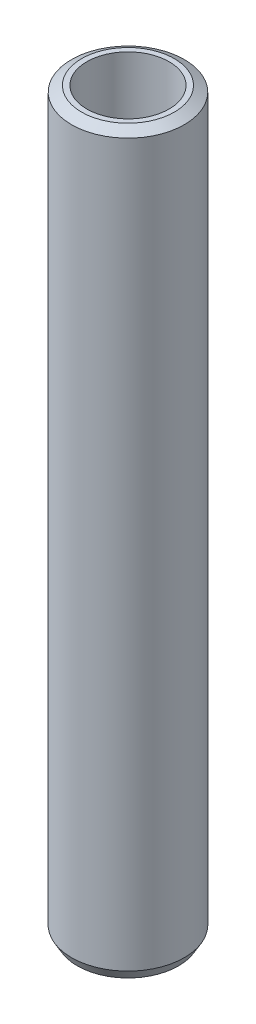
ISO-10303-21;
HEADER;
FILE_DESCRIPTION(('STEP AP214'),'2;1');
FILE_NAME('part.step','',(''),(''),'','','');
FILE_SCHEMA(('AUTOMOTIVE_DESIGN { 1 0 10303 214 1 1 1 1 }'));
ENDSEC;
DATA;
#1=APPLICATION_CONTEXT('core data for automotive mechanical design processes');
#2=APPLICATION_PROTOCOL_DEFINITION('international standard','automotive_design',2000,#1);
#3=PRODUCT_CONTEXT('',#1,'mechanical');
#4=PRODUCT('Part','Part','',(#3));
#5=PRODUCT_RELATED_PRODUCT_CATEGORY('part','',(#4));
#6=PRODUCT_DEFINITION_FORMATION('','',#4);
#7=PRODUCT_DEFINITION_CONTEXT('part definition',#1,'design');
#8=PRODUCT_DEFINITION('design','',#6,#7);
#9=PRODUCT_DEFINITION_SHAPE('','',#8);
#10=(LENGTH_UNIT() NAMED_UNIT(*) SI_UNIT(.MILLI.,.METRE.));
#11=(NAMED_UNIT(*) PLANE_ANGLE_UNIT() SI_UNIT($,.RADIAN.));
#12=(NAMED_UNIT(*) SI_UNIT($,.STERADIAN.) SOLID_ANGLE_UNIT());
#13=UNCERTAINTY_MEASURE_WITH_UNIT(LENGTH_MEASURE(1.E-05),#10,'distance_accuracy_value','');
#14=(GEOMETRIC_REPRESENTATION_CONTEXT(3) GLOBAL_UNCERTAINTY_ASSIGNED_CONTEXT((#13)) GLOBAL_UNIT_ASSIGNED_CONTEXT((#10,
#11,#12)) REPRESENTATION_CONTEXT('',''));
#15=CARTESIAN_POINT('',(0.,0.,0.));
#16=DIRECTION('',(0.,0.,1.));
#17=DIRECTION('',(1.,0.,0.));
#18=AXIS2_PLACEMENT_3D('',#15,#16,#17);
#19=CARTESIAN_POINT('',(0.,228.569906533185,0.));
#20=DIRECTION('',(0.,-1.,0.));
#21=DIRECTION('',(0.,0.,-1.));
#22=AXIS2_PLACEMENT_3D('',#19,#20,#21);
#23=CYLINDRICAL_SURFACE('',#22,17.5);
#24=CARTESIAN_POINT('',(0.,226.766769157187,0.));
#25=DIRECTION('',(0.,1.,0.));
#26=DIRECTION('',(0.,0.,1.));
#27=AXIS2_PLACEMENT_3D('',#24,#25,#26);
#28=CIRCLE('',#27,17.5);
#29=CARTESIAN_POINT('',(0.,226.766769157187,17.5));
#30=VERTEX_POINT('',#29);
#31=EDGE_CURVE('E50',#30,#30,#28,.F.);
#32=ORIENTED_EDGE('',*,*,#31,.T.);
#33=EDGE_LOOP('',(#32));
#34=FACE_BOUND('',#33,.T.);
#35=CARTESIAN_POINT('',(0.,3.12312554825511,0.));
#36=DIRECTION('',(0.,1.,0.));
#37=DIRECTION('',(0.,0.,1.));
#38=AXIS2_PLACEMENT_3D('',#35,#36,#37);
#39=CIRCLE('',#38,17.5);
#40=CARTESIAN_POINT('',(0.,3.12312554825511,17.5));
#41=VERTEX_POINT('',#40);
#42=EDGE_CURVE('E51',#41,#41,#39,.T.);
#43=ORIENTED_EDGE('',*,*,#42,.T.);
#44=EDGE_LOOP('',(#43));
#45=FACE_BOUND('',#44,.T.);
#46=ADVANCED_FACE('F39',(#34,#45),#23,.T.);
#47=CARTESIAN_POINT('',(0.,228.569906533185,0.));
#48=DIRECTION('',(0.,1.,0.));
#49=DIRECTION('',(0.,0.,1.));
#50=AXIS2_PLACEMENT_3D('',#47,#48,#49);
#51=PLANE('',#50);
#52=CARTESIAN_POINT('',(0.,228.569906533185,0.));
#53=DIRECTION('',(0.,1.,0.));
#54=DIRECTION('',(0.,0.,1.));
#55=AXIS2_PLACEMENT_3D('',#52,#53,#54);
#56=CIRCLE('',#55,14.376874451745);
#57=CARTESIAN_POINT('',(0.,228.569906533185,14.376874451745));
#58=VERTEX_POINT('',#57);
#59=EDGE_CURVE('E54',#58,#58,#56,.T.);
#60=ORIENTED_EDGE('',*,*,#59,.T.);
#61=EDGE_LOOP('',(#60));
#62=FACE_BOUND('',#61,.T.);
#63=CARTESIAN_POINT('',(0.,228.569906533185,0.));
#64=DIRECTION('',(0.,1.,0.));
#65=DIRECTION('',(0.,0.,1.));
#66=AXIS2_PLACEMENT_3D('',#63,#64,#65);
#67=CIRCLE('',#66,12.7397231707889);
#68=CARTESIAN_POINT('',(0.,228.569906533185,12.7397231707889));
#69=VERTEX_POINT('',#68);
#70=EDGE_CURVE('E58',#69,#69,#67,.T.);
#71=ORIENTED_EDGE('',*,*,#70,.F.);
#72=EDGE_LOOP('',(#71));
#73=FACE_BOUND('',#72,.T.);
#74=ADVANCED_FACE('F69',(#62,#73),#51,.T.);
#75=CARTESIAN_POINT('',(0.,0.,0.));
#76=DIRECTION('',(0.,1.,0.));
#77=DIRECTION('',(0.,0.,1.));
#78=AXIS2_PLACEMENT_3D('',#75,#76,#77);
#79=PLANE('',#78);
#80=CARTESIAN_POINT('',(0.,0.,0.));
#81=DIRECTION('',(0.,1.,0.));
#82=DIRECTION('',(0.,0.,1.));
#83=AXIS2_PLACEMENT_3D('',#80,#81,#82);
#84=CIRCLE('',#83,15.6968626240019);
#85=CARTESIAN_POINT('',(0.,0.,15.6968626240019));
#86=VERTEX_POINT('',#85);
#87=EDGE_CURVE('E10',#86,#86,#84,.F.);
#88=ORIENTED_EDGE('',*,*,#87,.T.);
#89=EDGE_LOOP('',(#88));
#90=FACE_BOUND('',#89,.T.);
#91=CARTESIAN_POINT('',(0.,0.,0.));
#92=DIRECTION('',(0.,1.,0.));
#93=DIRECTION('',(0.,0.,1.));
#94=AXIS2_PLACEMENT_3D('',#91,#92,#93);
#95=CIRCLE('',#94,12.7397231707889);
#96=CARTESIAN_POINT('',(0.,0.,12.7397231707889));
#97=VERTEX_POINT('',#96);
#98=EDGE_CURVE('E63',#97,#97,#95,.T.);
#99=ORIENTED_EDGE('',*,*,#98,.T.);
#100=EDGE_LOOP('',(#99));
#101=FACE_BOUND('',#100,.T.);
#102=ADVANCED_FACE('F75',(#90,#101),#79,.F.);
#103=CARTESIAN_POINT('',(0.,228.569906533185,0.));
#104=DIRECTION('',(0.,-1.,0.));
#105=DIRECTION('',(0.,0.,-1.));
#106=AXIS2_PLACEMENT_3D('',#103,#104,#105);
#107=CYLINDRICAL_SURFACE('',#106,12.7397231707889);
#108=ORIENTED_EDGE('',*,*,#70,.T.);
#109=EDGE_LOOP('',(#108));
#110=FACE_BOUND('',#109,.T.);
#111=ORIENTED_EDGE('',*,*,#98,.F.);
#112=EDGE_LOOP('',(#111));
#113=FACE_BOUND('',#112,.T.);
#114=ADVANCED_FACE('F70',(#110,#113),#107,.F.);
#115=CARTESIAN_POINT('',(0.,228.569906533185,0.));
#116=DIRECTION('',(0.,-1.,0.));
#117=DIRECTION('',(0.,0.,-1.));
#118=AXIS2_PLACEMENT_3D('',#115,#116,#117);
#119=CONICAL_SURFACE('',#118,14.376874451745,1.0471975511966);
#120=ORIENTED_EDGE('',*,*,#31,.F.);
#121=EDGE_LOOP('',(#120));
#122=FACE_BOUND('',#121,.T.);
#123=ORIENTED_EDGE('',*,*,#59,.F.);
#124=EDGE_LOOP('',(#123));
#125=FACE_BOUND('',#124,.T.);
#126=ADVANCED_FACE('F81',(#122,#125),#119,.T.);
#127=CARTESIAN_POINT('',(0.,3.12312554825511,0.));
#128=DIRECTION('',(0.,1.,0.));
#129=DIRECTION('',(0.,0.,1.));
#130=AXIS2_PLACEMENT_3D('',#127,#128,#129);
#131=CONICAL_SURFACE('',#130,17.5,0.523598775598301);
#132=ORIENTED_EDGE('',*,*,#87,.F.);
#133=EDGE_LOOP('',(#132));
#134=FACE_BOUND('',#133,.T.);
#135=ORIENTED_EDGE('',*,*,#42,.F.);
#136=EDGE_LOOP('',(#135));
#137=FACE_BOUND('',#136,.T.);
#138=ADVANCED_FACE('F45',(#134,#137),#131,.T.);
#139=CLOSED_SHELL('',(#46,#74,#102,#114,#126,#138));
#140=MANIFOLD_SOLID_BREP('B2',#139);
#141=ADVANCED_BREP_SHAPE_REPRESENTATION('',(#18,#140),#14);
#142=SHAPE_DEFINITION_REPRESENTATION(#9,#141);
ENDSEC;
END-ISO-10303-21;
